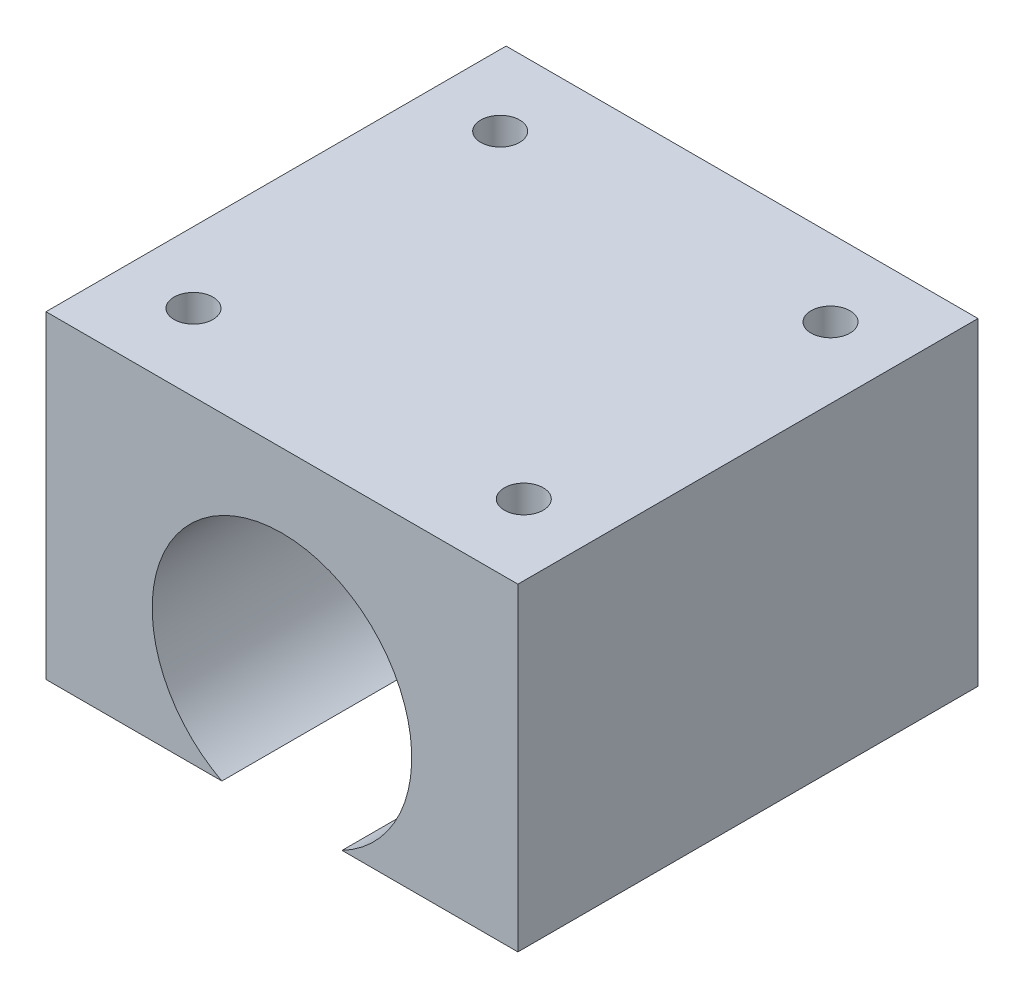
ISO-10303-21;
HEADER;
FILE_DESCRIPTION(('STEP AP214'),'2;1');
FILE_NAME('part.step','',(''),(''),'','','');
FILE_SCHEMA(('AUTOMOTIVE_DESIGN { 1 0 10303 214 1 1 1 1 }'));
ENDSEC;
DATA;
#1=APPLICATION_CONTEXT('core data for automotive mechanical design processes');
#2=APPLICATION_PROTOCOL_DEFINITION('international standard','automotive_design',2000,#1);
#3=PRODUCT_CONTEXT('',#1,'mechanical');
#4=PRODUCT('Part','Part','',(#3));
#5=PRODUCT_RELATED_PRODUCT_CATEGORY('part','',(#4));
#6=PRODUCT_DEFINITION_FORMATION('','',#4);
#7=PRODUCT_DEFINITION_CONTEXT('part definition',#1,'design');
#8=PRODUCT_DEFINITION('design','',#6,#7);
#9=PRODUCT_DEFINITION_SHAPE('','',#8);
#10=(LENGTH_UNIT() NAMED_UNIT(*) SI_UNIT(.MILLI.,.METRE.));
#11=(NAMED_UNIT(*) PLANE_ANGLE_UNIT() SI_UNIT($,.RADIAN.));
#12=(NAMED_UNIT(*) SI_UNIT($,.STERADIAN.) SOLID_ANGLE_UNIT());
#13=UNCERTAINTY_MEASURE_WITH_UNIT(LENGTH_MEASURE(1.E-05),#10,'distance_accuracy_value','');
#14=(GEOMETRIC_REPRESENTATION_CONTEXT(3) GLOBAL_UNCERTAINTY_ASSIGNED_CONTEXT((#13)) GLOBAL_UNIT_ASSIGNED_CONTEXT((#10,
#11,#12)) REPRESENTATION_CONTEXT('',''));
#15=CARTESIAN_POINT('',(0.,0.,0.));
#16=DIRECTION('',(0.,0.,1.));
#17=DIRECTION('',(1.,0.,0.));
#18=AXIS2_PLACEMENT_3D('',#15,#16,#17);
#19=CARTESIAN_POINT('',(-20.,17.25,39.));
#20=DIRECTION('',(1.,0.,0.));
#21=DIRECTION('',(0.,0.,-1.));
#22=AXIS2_PLACEMENT_3D('',#19,#20,#21);
#23=PLANE('',#22);
#24=DIRECTION('',(0.,-1.,0.));
#25=VECTOR('',#24,1.);
#26=CARTESIAN_POINT('',(-20.,17.25,0.));
#27=LINE('',#26,#25);
#28=CARTESIAN_POINT('',(-20.,17.25,0.));
#29=VERTEX_POINT('',#28);
#30=CARTESIAN_POINT('',(-20.,-9.75,0.));
#31=VERTEX_POINT('',#30);
#32=EDGE_CURVE('E128',#29,#31,#27,.T.);
#33=ORIENTED_EDGE('',*,*,#32,.T.);
#34=DIRECTION('',(0.,0.,-1.));
#35=VECTOR('',#34,1.);
#36=CARTESIAN_POINT('',(-20.,-9.75,39.));
#37=LINE('',#36,#35);
#38=CARTESIAN_POINT('',(-20.,-9.75,39.));
#39=VERTEX_POINT('',#38);
#40=EDGE_CURVE('E13',#39,#31,#37,.T.);
#41=ORIENTED_EDGE('',*,*,#40,.F.);
#42=DIRECTION('',(0.,-1.,0.));
#43=VECTOR('',#42,1.);
#44=CARTESIAN_POINT('',(-20.,17.25,39.));
#45=LINE('',#44,#43);
#46=CARTESIAN_POINT('',(-20.,17.25,39.));
#47=VERTEX_POINT('',#46);
#48=EDGE_CURVE('E139',#47,#39,#45,.T.);
#49=ORIENTED_EDGE('',*,*,#48,.F.);
#50=DIRECTION('',(0.,0.,-1.));
#51=VECTOR('',#50,1.);
#52=CARTESIAN_POINT('',(-20.,17.25,39.));
#53=LINE('',#52,#51);
#54=EDGE_CURVE('E124',#47,#29,#53,.T.);
#55=ORIENTED_EDGE('',*,*,#54,.T.);
#56=EDGE_LOOP('',(#33,#41,#49,#55));
#57=FACE_BOUND('',#56,.T.);
#58=ADVANCED_FACE('F44',(#57),#23,.F.);
#59=CARTESIAN_POINT('',(-20.,-9.75,39.));
#60=DIRECTION('',(0.,1.,0.));
#61=DIRECTION('',(0.,0.,1.));
#62=AXIS2_PLACEMENT_3D('',#59,#60,#61);
#63=PLANE('',#62);
#64=DIRECTION('',(1.,0.,0.));
#65=VECTOR('',#64,1.);
#66=CARTESIAN_POINT('',(-20.,-9.75,0.));
#67=LINE('',#66,#65);
#68=CARTESIAN_POINT('',(-5.09288719686585,-9.74999999999999,0.));
#69=VERTEX_POINT('',#68);
#70=EDGE_CURVE('E131',#31,#69,#67,.T.);
#71=ORIENTED_EDGE('',*,*,#70,.T.);
#72=DIRECTION('',(0.,0.,-1.));
#73=VECTOR('',#72,1.);
#74=CARTESIAN_POINT('',(-5.09288719686585,-9.74999999999999,39.));
#75=LINE('',#74,#73);
#76=CARTESIAN_POINT('',(-5.09288719686585,-9.74999999999999,39.));
#77=VERTEX_POINT('',#76);
#78=EDGE_CURVE('E52',#77,#69,#75,.T.);
#79=ORIENTED_EDGE('',*,*,#78,.F.);
#80=DIRECTION('',(1.,0.,0.));
#81=VECTOR('',#80,1.);
#82=CARTESIAN_POINT('',(-20.,-9.75,39.));
#83=LINE('',#82,#81);
#84=EDGE_CURVE('E97',#39,#77,#83,.T.);
#85=ORIENTED_EDGE('',*,*,#84,.F.);
#86=ORIENTED_EDGE('',*,*,#40,.T.);
#87=EDGE_LOOP('',(#71,#79,#85,#86));
#88=FACE_BOUND('',#87,.T.);
#89=ADVANCED_FACE('F166',(#88),#63,.F.);
#90=CARTESIAN_POINT('',(0.,0.,39.));
#91=DIRECTION('',(0.,0.,-1.));
#92=DIRECTION('',(-1.,0.,0.));
#93=AXIS2_PLACEMENT_3D('',#90,#91,#92);
#94=CYLINDRICAL_SURFACE('',#93,11.);
#95=CARTESIAN_POINT('',(0.,0.,0.));
#96=DIRECTION('',(0.,0.,-1.));
#97=DIRECTION('',(1.,0.,0.));
#98=AXIS2_PLACEMENT_3D('',#95,#96,#97);
#99=CIRCLE('',#98,11.);
#100=CARTESIAN_POINT('',(5.09288719686584,-9.75,0.));
#101=VERTEX_POINT('',#100);
#102=EDGE_CURVE('E134',#69,#101,#99,.T.);
#103=ORIENTED_EDGE('',*,*,#102,.T.);
#104=DIRECTION('',(0.,0.,-1.));
#105=VECTOR('',#104,1.);
#106=CARTESIAN_POINT('',(5.09288719686584,-9.75,39.));
#107=LINE('',#106,#105);
#108=CARTESIAN_POINT('',(5.09288719686584,-9.75,39.));
#109=VERTEX_POINT('',#108);
#110=EDGE_CURVE('E119',#109,#101,#107,.T.);
#111=ORIENTED_EDGE('',*,*,#110,.F.);
#112=CARTESIAN_POINT('',(0.,0.,39.));
#113=DIRECTION('',(0.,0.,-1.));
#114=DIRECTION('',(1.,0.,0.));
#115=AXIS2_PLACEMENT_3D('',#112,#113,#114);
#116=CIRCLE('',#115,11.);
#117=EDGE_CURVE('E110',#77,#109,#116,.T.);
#118=ORIENTED_EDGE('',*,*,#117,.F.);
#119=ORIENTED_EDGE('',*,*,#78,.T.);
#120=EDGE_LOOP('',(#103,#111,#118,#119));
#121=FACE_BOUND('',#120,.T.);
#122=ADVANCED_FACE('F145',(#121),#94,.F.);
#123=CARTESIAN_POINT('',(5.09288719686584,-9.75,39.));
#124=DIRECTION('',(0.,1.,0.));
#125=DIRECTION('',(0.,0.,1.));
#126=AXIS2_PLACEMENT_3D('',#123,#124,#125);
#127=PLANE('',#126);
#128=DIRECTION('',(1.,0.,0.));
#129=VECTOR('',#128,1.);
#130=CARTESIAN_POINT('',(5.09288719686584,-9.75,0.));
#131=LINE('',#130,#129);
#132=CARTESIAN_POINT('',(20.,-9.75,0.));
#133=VERTEX_POINT('',#132);
#134=EDGE_CURVE('E118',#101,#133,#131,.T.);
#135=ORIENTED_EDGE('',*,*,#134,.T.);
#136=DIRECTION('',(0.,0.,-1.));
#137=VECTOR('',#136,1.);
#138=CARTESIAN_POINT('',(20.,-9.75,39.));
#139=LINE('',#138,#137);
#140=CARTESIAN_POINT('',(20.,-9.75,39.));
#141=VERTEX_POINT('',#140);
#142=EDGE_CURVE('E115',#141,#133,#139,.T.);
#143=ORIENTED_EDGE('',*,*,#142,.F.);
#144=DIRECTION('',(1.,0.,0.));
#145=VECTOR('',#144,1.);
#146=CARTESIAN_POINT('',(5.09288719686584,-9.75,39.));
#147=LINE('',#146,#145);
#148=EDGE_CURVE('E104',#109,#141,#147,.T.);
#149=ORIENTED_EDGE('',*,*,#148,.F.);
#150=ORIENTED_EDGE('',*,*,#110,.T.);
#151=EDGE_LOOP('',(#135,#143,#149,#150));
#152=FACE_BOUND('',#151,.T.);
#153=ADVANCED_FACE('F116',(#152),#127,.F.);
#154=CARTESIAN_POINT('',(20.,-9.75,39.));
#155=DIRECTION('',(-1.,0.,0.));
#156=DIRECTION('',(0.,0.,1.));
#157=AXIS2_PLACEMENT_3D('',#154,#155,#156);
#158=PLANE('',#157);
#159=DIRECTION('',(0.,1.,0.));
#160=VECTOR('',#159,1.);
#161=CARTESIAN_POINT('',(20.,-9.75,0.));
#162=LINE('',#161,#160);
#163=CARTESIAN_POINT('',(20.,17.25,0.));
#164=VERTEX_POINT('',#163);
#165=EDGE_CURVE('E83',#133,#164,#162,.T.);
#166=ORIENTED_EDGE('',*,*,#165,.T.);
#167=DIRECTION('',(0.,0.,-1.));
#168=VECTOR('',#167,1.);
#169=CARTESIAN_POINT('',(20.,17.25,39.));
#170=LINE('',#169,#168);
#171=CARTESIAN_POINT('',(20.,17.25,39.));
#172=VERTEX_POINT('',#171);
#173=EDGE_CURVE('E120',#172,#164,#170,.T.);
#174=ORIENTED_EDGE('',*,*,#173,.F.);
#175=DIRECTION('',(0.,1.,0.));
#176=VECTOR('',#175,1.);
#177=CARTESIAN_POINT('',(20.,-9.75,39.));
#178=LINE('',#177,#176);
#179=EDGE_CURVE('E108',#141,#172,#178,.T.);
#180=ORIENTED_EDGE('',*,*,#179,.F.);
#181=ORIENTED_EDGE('',*,*,#142,.T.);
#182=EDGE_LOOP('',(#166,#174,#180,#181));
#183=FACE_BOUND('',#182,.T.);
#184=ADVANCED_FACE('F122',(#183),#158,.F.);
#185=CARTESIAN_POINT('',(-20.,17.25,39.));
#186=DIRECTION('',(0.,-1.,0.));
#187=DIRECTION('',(0.,0.,-1.));
#188=AXIS2_PLACEMENT_3D('',#185,#186,#187);
#189=PLANE('',#188);
#190=CARTESIAN_POINT('',(14.,17.25,6.49999999999999));
#191=DIRECTION('',(0.,1.,0.));
#192=DIRECTION('',(0.,0.,1.));
#193=AXIS2_PLACEMENT_3D('',#190,#191,#192);
#194=CIRCLE('',#193,1.65);
#195=CARTESIAN_POINT('',(14.,17.25,8.14999999999999));
#196=VERTEX_POINT('',#195);
#197=EDGE_CURVE('E289',#196,#196,#194,.T.);
#198=ORIENTED_EDGE('',*,*,#197,.F.);
#199=EDGE_LOOP('',(#198));
#200=FACE_BOUND('',#199,.T.);
#201=CARTESIAN_POINT('',(-14.,17.25,32.5));
#202=DIRECTION('',(0.,1.,0.));
#203=DIRECTION('',(0.,0.,1.));
#204=AXIS2_PLACEMENT_3D('',#201,#202,#203);
#205=CIRCLE('',#204,1.65);
#206=CARTESIAN_POINT('',(-14.,17.25,34.15));
#207=VERTEX_POINT('',#206);
#208=EDGE_CURVE('E299',#207,#207,#205,.T.);
#209=ORIENTED_EDGE('',*,*,#208,.F.);
#210=EDGE_LOOP('',(#209));
#211=FACE_BOUND('',#210,.T.);
#212=CARTESIAN_POINT('',(14.,17.25,32.5));
#213=DIRECTION('',(0.,1.,0.));
#214=DIRECTION('',(0.,0.,1.));
#215=AXIS2_PLACEMENT_3D('',#212,#213,#214);
#216=CIRCLE('',#215,1.65);
#217=CARTESIAN_POINT('',(14.,17.25,34.15));
#218=VERTEX_POINT('',#217);
#219=EDGE_CURVE('E305',#218,#218,#216,.T.);
#220=ORIENTED_EDGE('',*,*,#219,.F.);
#221=EDGE_LOOP('',(#220));
#222=FACE_BOUND('',#221,.T.);
#223=CARTESIAN_POINT('',(-14.,17.25,6.49999999999999));
#224=DIRECTION('',(0.,1.,0.));
#225=DIRECTION('',(0.,0.,1.));
#226=AXIS2_PLACEMENT_3D('',#223,#224,#225);
#227=CIRCLE('',#226,1.65);
#228=CARTESIAN_POINT('',(-14.,17.25,8.14999999999999));
#229=VERTEX_POINT('',#228);
#230=EDGE_CURVE('E288',#229,#229,#227,.T.);
#231=ORIENTED_EDGE('',*,*,#230,.F.);
#232=EDGE_LOOP('',(#231));
#233=FACE_BOUND('',#232,.T.);
#234=DIRECTION('',(-1.,0.,0.));
#235=VECTOR('',#234,1.);
#236=CARTESIAN_POINT('',(-20.,17.25,0.));
#237=LINE('',#236,#235);
#238=EDGE_CURVE('E89',#164,#29,#237,.T.);
#239=ORIENTED_EDGE('',*,*,#238,.T.);
#240=ORIENTED_EDGE('',*,*,#54,.F.);
#241=DIRECTION('',(-1.,0.,0.));
#242=VECTOR('',#241,1.);
#243=CARTESIAN_POINT('',(-20.,17.25,39.));
#244=LINE('',#243,#242);
#245=EDGE_CURVE('E60',#172,#47,#244,.T.);
#246=ORIENTED_EDGE('',*,*,#245,.F.);
#247=ORIENTED_EDGE('',*,*,#173,.T.);
#248=EDGE_LOOP('',(#239,#240,#246,#247));
#249=FACE_BOUND('',#248,.T.);
#250=ADVANCED_FACE('F152',(#200,#211,#222,#233,#249),#189,.F.);
#251=CARTESIAN_POINT('',(0.,0.,39.));
#252=DIRECTION('',(0.,0.,1.));
#253=DIRECTION('',(1.,0.,0.));
#254=AXIS2_PLACEMENT_3D('',#251,#252,#253);
#255=PLANE('',#254);
#256=ORIENTED_EDGE('',*,*,#48,.T.);
#257=ORIENTED_EDGE('',*,*,#84,.T.);
#258=ORIENTED_EDGE('',*,*,#117,.T.);
#259=ORIENTED_EDGE('',*,*,#148,.T.);
#260=ORIENTED_EDGE('',*,*,#179,.T.);
#261=ORIENTED_EDGE('',*,*,#245,.T.);
#262=EDGE_LOOP('',(#256,#257,#258,#259,#260,#261));
#263=FACE_BOUND('',#262,.T.);
#264=ADVANCED_FACE('F106',(#263),#255,.T.);
#265=CARTESIAN_POINT('',(0.,0.,0.));
#266=DIRECTION('',(0.,0.,1.));
#267=DIRECTION('',(1.,0.,0.));
#268=AXIS2_PLACEMENT_3D('',#265,#266,#267);
#269=PLANE('',#268);
#270=ORIENTED_EDGE('',*,*,#32,.F.);
#271=ORIENTED_EDGE('',*,*,#238,.F.);
#272=ORIENTED_EDGE('',*,*,#165,.F.);
#273=ORIENTED_EDGE('',*,*,#134,.F.);
#274=ORIENTED_EDGE('',*,*,#102,.F.);
#275=ORIENTED_EDGE('',*,*,#70,.F.);
#276=EDGE_LOOP('',(#270,#271,#272,#273,#274,#275));
#277=FACE_BOUND('',#276,.T.);
#278=ADVANCED_FACE('F148',(#277),#269,.F.);
#279=CARTESIAN_POINT('',(-14.,12.25,6.49999999999999));
#280=DIRECTION('',(0.,1.,0.));
#281=DIRECTION('',(0.,0.,1.));
#282=AXIS2_PLACEMENT_3D('',#279,#280,#281);
#283=CYLINDRICAL_SURFACE('',#282,1.65);
#284=CARTESIAN_POINT('',(-14.,12.25,6.49999999999999));
#285=DIRECTION('',(0.,1.,0.));
#286=DIRECTION('',(0.,0.,1.));
#287=AXIS2_PLACEMENT_3D('',#284,#285,#286);
#288=CIRCLE('',#287,1.65);
#289=CARTESIAN_POINT('',(-14.,12.25,8.14999999999999));
#290=VERTEX_POINT('',#289);
#291=EDGE_CURVE('E132',#290,#290,#288,.T.);
#292=ORIENTED_EDGE('',*,*,#291,.F.);
#293=EDGE_LOOP('',(#292));
#294=FACE_BOUND('',#293,.T.);
#295=ORIENTED_EDGE('',*,*,#230,.T.);
#296=EDGE_LOOP('',(#295));
#297=FACE_BOUND('',#296,.T.);
#298=ADVANCED_FACE('F199',(#294,#297),#283,.F.);
#299=CARTESIAN_POINT('',(-14.,12.25,6.49999999999999));
#300=DIRECTION('',(0.,1.,0.));
#301=DIRECTION('',(0.,0.,1.));
#302=AXIS2_PLACEMENT_3D('',#299,#300,#301);
#303=PLANE('',#302);
#304=ORIENTED_EDGE('',*,*,#291,.T.);
#305=EDGE_LOOP('',(#304));
#306=FACE_BOUND('',#305,.T.);
#307=ADVANCED_FACE('F211',(#306),#303,.T.);
#308=CARTESIAN_POINT('',(14.,12.25,32.5));
#309=DIRECTION('',(0.,1.,0.));
#310=DIRECTION('',(0.,0.,1.));
#311=AXIS2_PLACEMENT_3D('',#308,#309,#310);
#312=CYLINDRICAL_SURFACE('',#311,1.65);
#313=CARTESIAN_POINT('',(14.,12.25,32.5));
#314=DIRECTION('',(0.,1.,0.));
#315=DIRECTION('',(0.,0.,1.));
#316=AXIS2_PLACEMENT_3D('',#313,#314,#315);
#317=CIRCLE('',#316,1.65);
#318=CARTESIAN_POINT('',(14.,12.25,34.15));
#319=VERTEX_POINT('',#318);
#320=EDGE_CURVE('E302',#319,#319,#317,.T.);
#321=ORIENTED_EDGE('',*,*,#320,.F.);
#322=EDGE_LOOP('',(#321));
#323=FACE_BOUND('',#322,.T.);
#324=ORIENTED_EDGE('',*,*,#219,.T.);
#325=EDGE_LOOP('',(#324));
#326=FACE_BOUND('',#325,.T.);
#327=ADVANCED_FACE('F221',(#323,#326),#312,.F.);
#328=CARTESIAN_POINT('',(14.,12.25,32.5));
#329=DIRECTION('',(0.,1.,0.));
#330=DIRECTION('',(0.,0.,1.));
#331=AXIS2_PLACEMENT_3D('',#328,#329,#330);
#332=PLANE('',#331);
#333=ORIENTED_EDGE('',*,*,#320,.T.);
#334=EDGE_LOOP('',(#333));
#335=FACE_BOUND('',#334,.T.);
#336=ADVANCED_FACE('F231',(#335),#332,.T.);
#337=CARTESIAN_POINT('',(-14.,12.25,32.5));
#338=DIRECTION('',(0.,1.,0.));
#339=DIRECTION('',(0.,0.,1.));
#340=AXIS2_PLACEMENT_3D('',#337,#338,#339);
#341=CYLINDRICAL_SURFACE('',#340,1.65);
#342=CARTESIAN_POINT('',(-14.,12.25,32.5));
#343=DIRECTION('',(0.,1.,0.));
#344=DIRECTION('',(0.,0.,1.));
#345=AXIS2_PLACEMENT_3D('',#342,#343,#344);
#346=CIRCLE('',#345,1.65);
#347=CARTESIAN_POINT('',(-14.,12.25,34.15));
#348=VERTEX_POINT('',#347);
#349=EDGE_CURVE('E294',#348,#348,#346,.T.);
#350=ORIENTED_EDGE('',*,*,#349,.F.);
#351=EDGE_LOOP('',(#350));
#352=FACE_BOUND('',#351,.T.);
#353=ORIENTED_EDGE('',*,*,#208,.T.);
#354=EDGE_LOOP('',(#353));
#355=FACE_BOUND('',#354,.T.);
#356=ADVANCED_FACE('F241',(#352,#355),#341,.F.);
#357=CARTESIAN_POINT('',(-14.,12.25,32.5));
#358=DIRECTION('',(0.,1.,0.));
#359=DIRECTION('',(0.,0.,1.));
#360=AXIS2_PLACEMENT_3D('',#357,#358,#359);
#361=PLANE('',#360);
#362=ORIENTED_EDGE('',*,*,#349,.T.);
#363=EDGE_LOOP('',(#362));
#364=FACE_BOUND('',#363,.T.);
#365=ADVANCED_FACE('F251',(#364),#361,.T.);
#366=CARTESIAN_POINT('',(14.,12.25,6.49999999999999));
#367=DIRECTION('',(0.,1.,0.));
#368=DIRECTION('',(0.,0.,1.));
#369=AXIS2_PLACEMENT_3D('',#366,#367,#368);
#370=CYLINDRICAL_SURFACE('',#369,1.65);
#371=CARTESIAN_POINT('',(14.,12.25,6.49999999999999));
#372=DIRECTION('',(0.,1.,0.));
#373=DIRECTION('',(0.,0.,1.));
#374=AXIS2_PLACEMENT_3D('',#371,#372,#373);
#375=CIRCLE('',#374,1.65);
#376=CARTESIAN_POINT('',(14.,12.25,8.14999999999999));
#377=VERTEX_POINT('',#376);
#378=EDGE_CURVE('E287',#377,#377,#375,.T.);
#379=ORIENTED_EDGE('',*,*,#378,.F.);
#380=EDGE_LOOP('',(#379));
#381=FACE_BOUND('',#380,.T.);
#382=ORIENTED_EDGE('',*,*,#197,.T.);
#383=EDGE_LOOP('',(#382));
#384=FACE_BOUND('',#383,.T.);
#385=ADVANCED_FACE('F261',(#381,#384),#370,.F.);
#386=CARTESIAN_POINT('',(14.,12.25,6.49999999999999));
#387=DIRECTION('',(0.,1.,0.));
#388=DIRECTION('',(0.,0.,1.));
#389=AXIS2_PLACEMENT_3D('',#386,#387,#388);
#390=PLANE('',#389);
#391=ORIENTED_EDGE('',*,*,#378,.T.);
#392=EDGE_LOOP('',(#391));
#393=FACE_BOUND('',#392,.T.);
#394=ADVANCED_FACE('F271',(#393),#390,.T.);
#395=CLOSED_SHELL('',(#58,#89,#122,#153,#184,#250,#264,#278,#298,#307,#327,#336,#356,#365,#385,#394));
#396=MANIFOLD_SOLID_BREP('B2',#395);
#397=ADVANCED_BREP_SHAPE_REPRESENTATION('',(#18,#396),#14);
#398=SHAPE_DEFINITION_REPRESENTATION(#9,#397);
ENDSEC;
END-ISO-10303-21;
